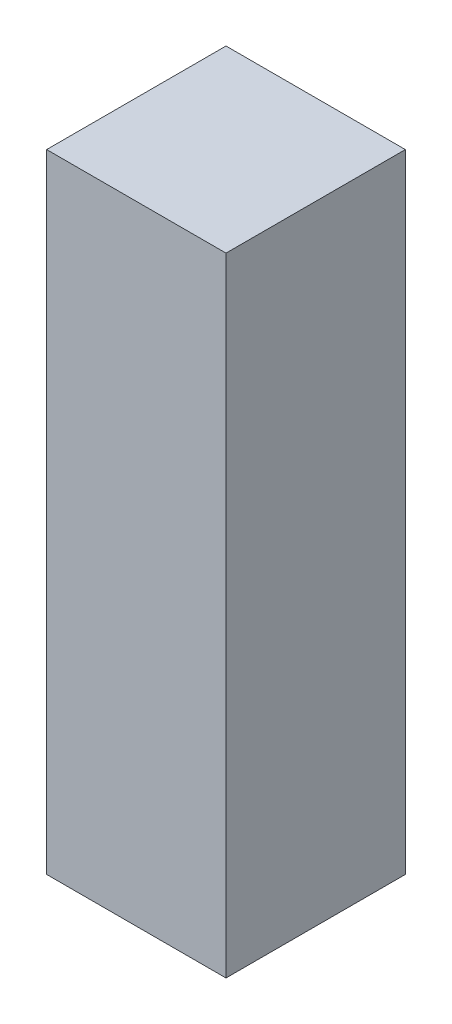
ISO-10303-21;
HEADER;
FILE_DESCRIPTION(('STEP AP214'),'2;1');
FILE_NAME('part.step','',(''),(''),'','','');
FILE_SCHEMA(('AUTOMOTIVE_DESIGN { 1 0 10303 214 1 1 1 1 }'));
ENDSEC;
DATA;
#1=APPLICATION_CONTEXT('core data for automotive mechanical design processes');
#2=APPLICATION_PROTOCOL_DEFINITION('international standard','automotive_design',2000,#1);
#3=PRODUCT_CONTEXT('',#1,'mechanical');
#4=PRODUCT('Part','Part','',(#3));
#5=PRODUCT_RELATED_PRODUCT_CATEGORY('part','',(#4));
#6=PRODUCT_DEFINITION_FORMATION('','',#4);
#7=PRODUCT_DEFINITION_CONTEXT('part definition',#1,'design');
#8=PRODUCT_DEFINITION('design','',#6,#7);
#9=PRODUCT_DEFINITION_SHAPE('','',#8);
#10=(LENGTH_UNIT() NAMED_UNIT(*) SI_UNIT(.MILLI.,.METRE.));
#11=(NAMED_UNIT(*) PLANE_ANGLE_UNIT() SI_UNIT($,.RADIAN.));
#12=(NAMED_UNIT(*) SI_UNIT($,.STERADIAN.) SOLID_ANGLE_UNIT());
#13=UNCERTAINTY_MEASURE_WITH_UNIT(LENGTH_MEASURE(1.E-05),#10,'distance_accuracy_value','');
#14=(GEOMETRIC_REPRESENTATION_CONTEXT(3) GLOBAL_UNCERTAINTY_ASSIGNED_CONTEXT((#13)) GLOBAL_UNIT_ASSIGNED_CONTEXT((#10,
#11,#12)) REPRESENTATION_CONTEXT('',''));
#15=CARTESIAN_POINT('',(0.,0.,0.));
#16=DIRECTION('',(0.,0.,1.));
#17=DIRECTION('',(1.,0.,0.));
#18=AXIS2_PLACEMENT_3D('',#15,#16,#17);
#19=CARTESIAN_POINT('',(-300.,2100.,-300.));
#20=DIRECTION('',(1.,0.,0.));
#21=DIRECTION('',(0.,0.,-1.));
#22=AXIS2_PLACEMENT_3D('',#19,#20,#21);
#23=PLANE('',#22);
#24=DIRECTION('',(0.,0.,1.));
#25=VECTOR('',#24,1.);
#26=CARTESIAN_POINT('',(-300.,0.,-300.));
#27=LINE('',#26,#25);
#28=CARTESIAN_POINT('',(-300.,0.,-300.));
#29=VERTEX_POINT('',#28);
#30=CARTESIAN_POINT('',(-300.,0.,300.));
#31=VERTEX_POINT('',#30);
#32=EDGE_CURVE('E98',#29,#31,#27,.T.);
#33=ORIENTED_EDGE('',*,*,#32,.T.);
#34=DIRECTION('',(0.,-1.,0.));
#35=VECTOR('',#34,1.);
#36=CARTESIAN_POINT('',(-300.,2100.,300.));
#37=LINE('',#36,#35);
#38=CARTESIAN_POINT('',(-300.,2100.,300.));
#39=VERTEX_POINT('',#38);
#40=EDGE_CURVE('E11',#39,#31,#37,.T.);
#41=ORIENTED_EDGE('',*,*,#40,.F.);
#42=DIRECTION('',(0.,0.,1.));
#43=VECTOR('',#42,1.);
#44=CARTESIAN_POINT('',(-300.,2100.,-300.));
#45=LINE('',#44,#43);
#46=CARTESIAN_POINT('',(-300.,2100.,-300.));
#47=VERTEX_POINT('',#46);
#48=EDGE_CURVE('E86',#47,#39,#45,.T.);
#49=ORIENTED_EDGE('',*,*,#48,.F.);
#50=DIRECTION('',(0.,-1.,0.));
#51=VECTOR('',#50,1.);
#52=CARTESIAN_POINT('',(-300.,2100.,-300.));
#53=LINE('',#52,#51);
#54=EDGE_CURVE('E94',#47,#29,#53,.T.);
#55=ORIENTED_EDGE('',*,*,#54,.T.);
#56=EDGE_LOOP('',(#33,#41,#49,#55));
#57=FACE_BOUND('',#56,.T.);
#58=ADVANCED_FACE('F35',(#57),#23,.F.);
#59=CARTESIAN_POINT('',(300.,2100.,300.));
#60=DIRECTION('',(0.,0.,-1.));
#61=DIRECTION('',(-1.,0.,0.));
#62=AXIS2_PLACEMENT_3D('',#59,#60,#61);
#63=PLANE('',#62);
#64=DIRECTION('',(1.,0.,0.));
#65=VECTOR('',#64,1.);
#66=CARTESIAN_POINT('',(300.,0.,300.));
#67=LINE('',#66,#65);
#68=CARTESIAN_POINT('',(300.,0.,300.));
#69=VERTEX_POINT('',#68);
#70=EDGE_CURVE('E90',#31,#69,#67,.T.);
#71=ORIENTED_EDGE('',*,*,#70,.T.);
#72=DIRECTION('',(0.,-1.,0.));
#73=VECTOR('',#72,1.);
#74=CARTESIAN_POINT('',(300.,2100.,300.));
#75=LINE('',#74,#73);
#76=CARTESIAN_POINT('',(300.,2100.,300.));
#77=VERTEX_POINT('',#76);
#78=EDGE_CURVE('E43',#77,#69,#75,.T.);
#79=ORIENTED_EDGE('',*,*,#78,.F.);
#80=DIRECTION('',(1.,0.,0.));
#81=VECTOR('',#80,1.);
#82=CARTESIAN_POINT('',(300.,2100.,300.));
#83=LINE('',#82,#81);
#84=EDGE_CURVE('E81',#39,#77,#83,.T.);
#85=ORIENTED_EDGE('',*,*,#84,.F.);
#86=ORIENTED_EDGE('',*,*,#40,.T.);
#87=EDGE_LOOP('',(#71,#79,#85,#86));
#88=FACE_BOUND('',#87,.T.);
#89=ADVANCED_FACE('F89',(#88),#63,.F.);
#90=CARTESIAN_POINT('',(300.,2100.,-300.));
#91=DIRECTION('',(-1.,0.,0.));
#92=DIRECTION('',(0.,0.,1.));
#93=AXIS2_PLACEMENT_3D('',#90,#91,#92);
#94=PLANE('',#93);
#95=DIRECTION('',(0.,0.,-1.));
#96=VECTOR('',#95,1.);
#97=CARTESIAN_POINT('',(300.,0.,-300.));
#98=LINE('',#97,#96);
#99=CARTESIAN_POINT('',(300.,0.,-300.));
#100=VERTEX_POINT('',#99);
#101=EDGE_CURVE('E68',#69,#100,#98,.T.);
#102=ORIENTED_EDGE('',*,*,#101,.T.);
#103=DIRECTION('',(0.,-1.,0.));
#104=VECTOR('',#103,1.);
#105=CARTESIAN_POINT('',(300.,2100.,-300.));
#106=LINE('',#105,#104);
#107=CARTESIAN_POINT('',(300.,2100.,-300.));
#108=VERTEX_POINT('',#107);
#109=EDGE_CURVE('E91',#108,#100,#106,.T.);
#110=ORIENTED_EDGE('',*,*,#109,.F.);
#111=DIRECTION('',(0.,0.,-1.));
#112=VECTOR('',#111,1.);
#113=CARTESIAN_POINT('',(300.,2100.,-300.));
#114=LINE('',#113,#112);
#115=EDGE_CURVE('E84',#77,#108,#114,.T.);
#116=ORIENTED_EDGE('',*,*,#115,.F.);
#117=ORIENTED_EDGE('',*,*,#78,.T.);
#118=EDGE_LOOP('',(#102,#110,#116,#117));
#119=FACE_BOUND('',#118,.T.);
#120=ADVANCED_FACE('F92',(#119),#94,.F.);
#121=CARTESIAN_POINT('',(300.,2100.,-300.));
#122=DIRECTION('',(0.,0.,1.));
#123=DIRECTION('',(1.,0.,0.));
#124=AXIS2_PLACEMENT_3D('',#121,#122,#123);
#125=PLANE('',#124);
#126=DIRECTION('',(-1.,0.,0.));
#127=VECTOR('',#126,1.);
#128=CARTESIAN_POINT('',(300.,0.,-300.));
#129=LINE('',#128,#127);
#130=EDGE_CURVE('E74',#100,#29,#129,.T.);
#131=ORIENTED_EDGE('',*,*,#130,.T.);
#132=ORIENTED_EDGE('',*,*,#54,.F.);
#133=DIRECTION('',(-1.,0.,0.));
#134=VECTOR('',#133,1.);
#135=CARTESIAN_POINT('',(300.,2100.,-300.));
#136=LINE('',#135,#134);
#137=EDGE_CURVE('E51',#108,#47,#136,.T.);
#138=ORIENTED_EDGE('',*,*,#137,.F.);
#139=ORIENTED_EDGE('',*,*,#109,.T.);
#140=EDGE_LOOP('',(#131,#132,#138,#139));
#141=FACE_BOUND('',#140,.T.);
#142=ADVANCED_FACE('F105',(#141),#125,.F.);
#143=CARTESIAN_POINT('',(0.,2100.,0.));
#144=DIRECTION('',(0.,-1.,0.));
#145=DIRECTION('',(0.,0.,-1.));
#146=AXIS2_PLACEMENT_3D('',#143,#144,#145);
#147=PLANE('',#146);
#148=ORIENTED_EDGE('',*,*,#48,.T.);
#149=ORIENTED_EDGE('',*,*,#84,.T.);
#150=ORIENTED_EDGE('',*,*,#115,.T.);
#151=ORIENTED_EDGE('',*,*,#137,.T.);
#152=EDGE_LOOP('',(#148,#149,#150,#151));
#153=FACE_BOUND('',#152,.T.);
#154=ADVANCED_FACE('F82',(#153),#147,.F.);
#155=CARTESIAN_POINT('',(0.,0.,0.));
#156=DIRECTION('',(0.,-1.,0.));
#157=DIRECTION('',(0.,0.,-1.));
#158=AXIS2_PLACEMENT_3D('',#155,#156,#157);
#159=PLANE('',#158);
#160=ORIENTED_EDGE('',*,*,#32,.F.);
#161=ORIENTED_EDGE('',*,*,#130,.F.);
#162=ORIENTED_EDGE('',*,*,#101,.F.);
#163=ORIENTED_EDGE('',*,*,#70,.F.);
#164=EDGE_LOOP('',(#160,#161,#162,#163));
#165=FACE_BOUND('',#164,.T.);
#166=ADVANCED_FACE('F108',(#165),#159,.T.);
#167=CLOSED_SHELL('',(#58,#89,#120,#142,#154,#166));
#168=MANIFOLD_SOLID_BREP('B2',#167);
#169=ADVANCED_BREP_SHAPE_REPRESENTATION('',(#18,#168),#14);
#170=SHAPE_DEFINITION_REPRESENTATION(#9,#169);
ENDSEC;
END-ISO-10303-21;
